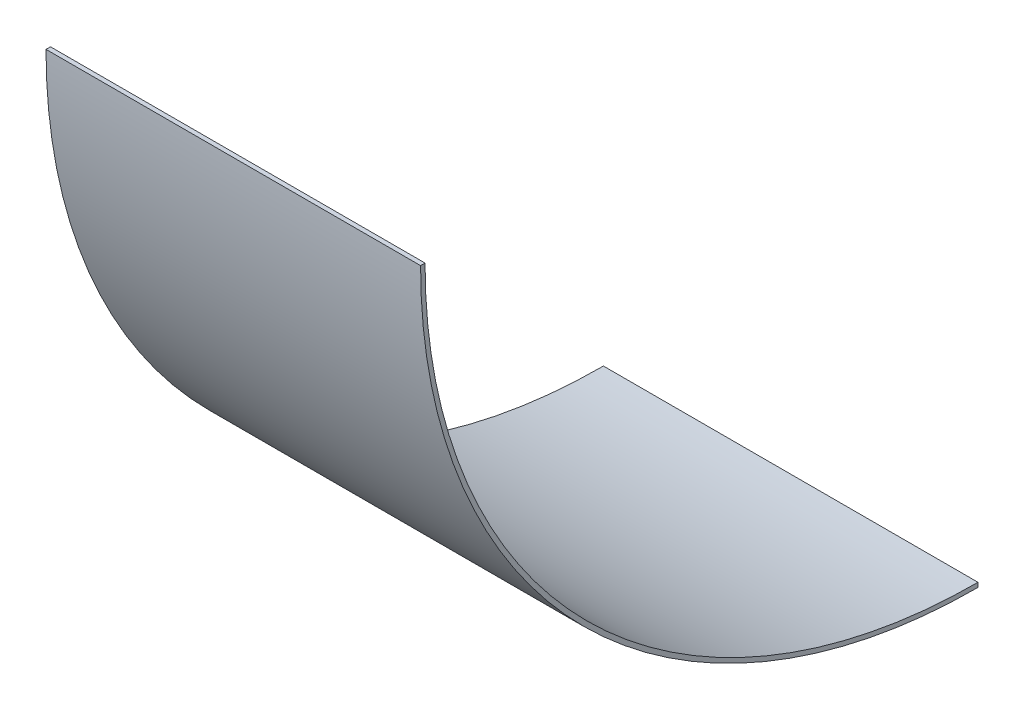
ISO-10303-21;
HEADER;
FILE_DESCRIPTION(('STEP AP214'),'2;1');
FILE_NAME('part.step','',(''),(''),'','','');
FILE_SCHEMA(('AUTOMOTIVE_DESIGN { 1 0 10303 214 1 1 1 1 }'));
ENDSEC;
DATA;
#1=APPLICATION_CONTEXT('core data for automotive mechanical design processes');
#2=APPLICATION_PROTOCOL_DEFINITION('international standard','automotive_design',2000,#1);
#3=PRODUCT_CONTEXT('',#1,'mechanical');
#4=PRODUCT('Part','Part','',(#3));
#5=PRODUCT_RELATED_PRODUCT_CATEGORY('part','',(#4));
#6=PRODUCT_DEFINITION_FORMATION('','',#4);
#7=PRODUCT_DEFINITION_CONTEXT('part definition',#1,'design');
#8=PRODUCT_DEFINITION('design','',#6,#7);
#9=PRODUCT_DEFINITION_SHAPE('','',#8);
#10=(LENGTH_UNIT() NAMED_UNIT(*) SI_UNIT(.MILLI.,.METRE.));
#11=(NAMED_UNIT(*) PLANE_ANGLE_UNIT() SI_UNIT($,.RADIAN.));
#12=(NAMED_UNIT(*) SI_UNIT($,.STERADIAN.) SOLID_ANGLE_UNIT());
#13=UNCERTAINTY_MEASURE_WITH_UNIT(LENGTH_MEASURE(1.E-05),#10,'distance_accuracy_value','');
#14=(GEOMETRIC_REPRESENTATION_CONTEXT(3) GLOBAL_UNCERTAINTY_ASSIGNED_CONTEXT((#13)) GLOBAL_UNIT_ASSIGNED_CONTEXT((#10,
#11,#12)) REPRESENTATION_CONTEXT('',''));
#15=CARTESIAN_POINT('',(0.,0.,0.));
#16=DIRECTION('',(0.,0.,1.));
#17=DIRECTION('',(1.,0.,0.));
#18=AXIS2_PLACEMENT_3D('',#15,#16,#17);
#19=CARTESIAN_POINT('',(133.35,0.,0.));
#20=DIRECTION('',(-1.,0.,0.));
#21=DIRECTION('',(0.,0.,1.));
#22=AXIS2_PLACEMENT_3D('',#19,#20,#21);
#23=CYLINDRICAL_SURFACE('',#22,198.4375);
#24=CARTESIAN_POINT('',(0.,0.,0.));
#25=DIRECTION('',(1.,0.,0.));
#26=DIRECTION('',(0.,0.,-1.));
#27=AXIS2_PLACEMENT_3D('',#24,#25,#26);
#28=CIRCLE('',#27,198.4375);
#29=CARTESIAN_POINT('',(0.,0.,198.4375));
#30=VERTEX_POINT('',#29);
#31=CARTESIAN_POINT('',(0.,-198.4375,0.));
#32=VERTEX_POINT('',#31);
#33=EDGE_CURVE('E95',#30,#32,#28,.T.);
#34=ORIENTED_EDGE('',*,*,#33,.T.);
#35=DIRECTION('',(-1.,0.,0.));
#36=VECTOR('',#35,1.);
#37=CARTESIAN_POINT('',(133.35,-198.4375,0.));
#38=LINE('',#37,#36);
#39=CARTESIAN_POINT('',(133.35,-198.4375,0.));
#40=VERTEX_POINT('',#39);
#41=EDGE_CURVE('E11',#40,#32,#38,.T.);
#42=ORIENTED_EDGE('',*,*,#41,.F.);
#43=CARTESIAN_POINT('',(133.35,0.,0.));
#44=DIRECTION('',(1.,0.,0.));
#45=DIRECTION('',(0.,0.,-1.));
#46=AXIS2_PLACEMENT_3D('',#43,#44,#45);
#47=CIRCLE('',#46,198.4375);
#48=CARTESIAN_POINT('',(133.35,0.,198.4375));
#49=VERTEX_POINT('',#48);
#50=EDGE_CURVE('E72',#49,#40,#47,.T.);
#51=ORIENTED_EDGE('',*,*,#50,.F.);
#52=DIRECTION('',(-1.,0.,0.));
#53=VECTOR('',#52,1.);
#54=CARTESIAN_POINT('',(133.35,0.,198.4375));
#55=LINE('',#54,#53);
#56=EDGE_CURVE('E48',#49,#30,#55,.T.);
#57=ORIENTED_EDGE('',*,*,#56,.T.);
#58=EDGE_LOOP('',(#34,#42,#51,#57));
#59=FACE_BOUND('',#58,.T.);
#60=ADVANCED_FACE('F32',(#59),#23,.T.);
#61=CARTESIAN_POINT('',(133.35,-196.85,0.));
#62=DIRECTION('',(0.,0.,-1.));
#63=DIRECTION('',(0.,1.,0.));
#64=AXIS2_PLACEMENT_3D('',#61,#62,#63);
#65=PLANE('',#64);
#66=DIRECTION('',(0.,-1.,0.));
#67=VECTOR('',#66,1.);
#68=CARTESIAN_POINT('',(0.,-196.85,0.));
#69=LINE('',#68,#67);
#70=CARTESIAN_POINT('',(0.,-196.85,0.));
#71=VERTEX_POINT('',#70);
#72=EDGE_CURVE('E81',#71,#32,#69,.T.);
#73=ORIENTED_EDGE('',*,*,#72,.F.);
#74=DIRECTION('',(-1.,0.,0.));
#75=VECTOR('',#74,1.);
#76=CARTESIAN_POINT('',(133.35,-196.85,0.));
#77=LINE('',#76,#75);
#78=CARTESIAN_POINT('',(133.35,-196.85,0.));
#79=VERTEX_POINT('',#78);
#80=EDGE_CURVE('E40',#79,#71,#77,.T.);
#81=ORIENTED_EDGE('',*,*,#80,.F.);
#82=DIRECTION('',(0.,-1.,0.));
#83=VECTOR('',#82,1.);
#84=CARTESIAN_POINT('',(133.35,-196.85,0.));
#85=LINE('',#84,#83);
#86=EDGE_CURVE('E79',#79,#40,#85,.T.);
#87=ORIENTED_EDGE('',*,*,#86,.T.);
#88=ORIENTED_EDGE('',*,*,#41,.T.);
#89=EDGE_LOOP('',(#73,#81,#87,#88));
#90=FACE_BOUND('',#89,.T.);
#91=ADVANCED_FACE('F78',(#90),#65,.T.);
#92=CARTESIAN_POINT('',(133.35,0.,0.));
#93=DIRECTION('',(-1.,0.,0.));
#94=DIRECTION('',(0.,0.,1.));
#95=AXIS2_PLACEMENT_3D('',#92,#93,#94);
#96=CYLINDRICAL_SURFACE('',#95,196.85);
#97=CARTESIAN_POINT('',(0.,0.,0.));
#98=DIRECTION('',(1.,0.,0.));
#99=DIRECTION('',(0.,0.,-1.));
#100=AXIS2_PLACEMENT_3D('',#97,#98,#99);
#101=CIRCLE('',#100,196.85);
#102=CARTESIAN_POINT('',(0.,0.,196.85));
#103=VERTEX_POINT('',#102);
#104=EDGE_CURVE('E98',#103,#71,#101,.T.);
#105=ORIENTED_EDGE('',*,*,#104,.F.);
#106=DIRECTION('',(-1.,0.,0.));
#107=VECTOR('',#106,1.);
#108=CARTESIAN_POINT('',(133.35,0.,196.85));
#109=LINE('',#108,#107);
#110=CARTESIAN_POINT('',(133.35,0.,196.85));
#111=VERTEX_POINT('',#110);
#112=EDGE_CURVE('E61',#111,#103,#109,.T.);
#113=ORIENTED_EDGE('',*,*,#112,.F.);
#114=CARTESIAN_POINT('',(133.35,0.,0.));
#115=DIRECTION('',(1.,0.,0.));
#116=DIRECTION('',(0.,0.,-1.));
#117=AXIS2_PLACEMENT_3D('',#114,#115,#116);
#118=CIRCLE('',#117,196.85);
#119=EDGE_CURVE('E87',#111,#79,#118,.T.);
#120=ORIENTED_EDGE('',*,*,#119,.T.);
#121=ORIENTED_EDGE('',*,*,#80,.T.);
#122=EDGE_LOOP('',(#105,#113,#120,#121));
#123=FACE_BOUND('',#122,.T.);
#124=ADVANCED_FACE('F89',(#123),#96,.F.);
#125=CARTESIAN_POINT('',(133.35,0.,198.4375));
#126=DIRECTION('',(0.,1.,0.));
#127=DIRECTION('',(0.,0.,1.));
#128=AXIS2_PLACEMENT_3D('',#125,#126,#127);
#129=PLANE('',#128);
#130=DIRECTION('',(0.,0.,-1.));
#131=VECTOR('',#130,1.);
#132=CARTESIAN_POINT('',(0.,0.,198.4375));
#133=LINE('',#132,#131);
#134=EDGE_CURVE('E100',#30,#103,#133,.T.);
#135=ORIENTED_EDGE('',*,*,#134,.F.);
#136=ORIENTED_EDGE('',*,*,#56,.F.);
#137=DIRECTION('',(0.,0.,-1.));
#138=VECTOR('',#137,1.);
#139=CARTESIAN_POINT('',(133.35,0.,198.4375));
#140=LINE('',#139,#138);
#141=EDGE_CURVE('E90',#49,#111,#140,.T.);
#142=ORIENTED_EDGE('',*,*,#141,.T.);
#143=ORIENTED_EDGE('',*,*,#112,.T.);
#144=EDGE_LOOP('',(#135,#136,#142,#143));
#145=FACE_BOUND('',#144,.T.);
#146=ADVANCED_FACE('F106',(#145),#129,.T.);
#147=CARTESIAN_POINT('',(133.35,0.,0.));
#148=DIRECTION('',(1.,0.,0.));
#149=DIRECTION('',(0.,0.,-1.));
#150=AXIS2_PLACEMENT_3D('',#147,#148,#149);
#151=PLANE('',#150);
#152=ORIENTED_EDGE('',*,*,#50,.T.);
#153=ORIENTED_EDGE('',*,*,#86,.F.);
#154=ORIENTED_EDGE('',*,*,#119,.F.);
#155=ORIENTED_EDGE('',*,*,#141,.F.);
#156=EDGE_LOOP('',(#152,#153,#154,#155));
#157=FACE_BOUND('',#156,.T.);
#158=ADVANCED_FACE('F86',(#157),#151,.T.);
#159=CARTESIAN_POINT('',(0.,0.,0.));
#160=DIRECTION('',(1.,0.,0.));
#161=DIRECTION('',(0.,0.,-1.));
#162=AXIS2_PLACEMENT_3D('',#159,#160,#161);
#163=PLANE('',#162);
#164=ORIENTED_EDGE('',*,*,#33,.F.);
#165=ORIENTED_EDGE('',*,*,#134,.T.);
#166=ORIENTED_EDGE('',*,*,#104,.T.);
#167=ORIENTED_EDGE('',*,*,#72,.T.);
#168=EDGE_LOOP('',(#164,#165,#166,#167));
#169=FACE_BOUND('',#168,.T.);
#170=ADVANCED_FACE('F105',(#169),#163,.F.);
#171=CLOSED_SHELL('',(#60,#91,#124,#146,#158,#170));
#172=MANIFOLD_SOLID_BREP('B2',#171);
#173=ADVANCED_BREP_SHAPE_REPRESENTATION('',(#18,#172),#14);
#174=SHAPE_DEFINITION_REPRESENTATION(#9,#173);
ENDSEC;
END-ISO-10303-21;
